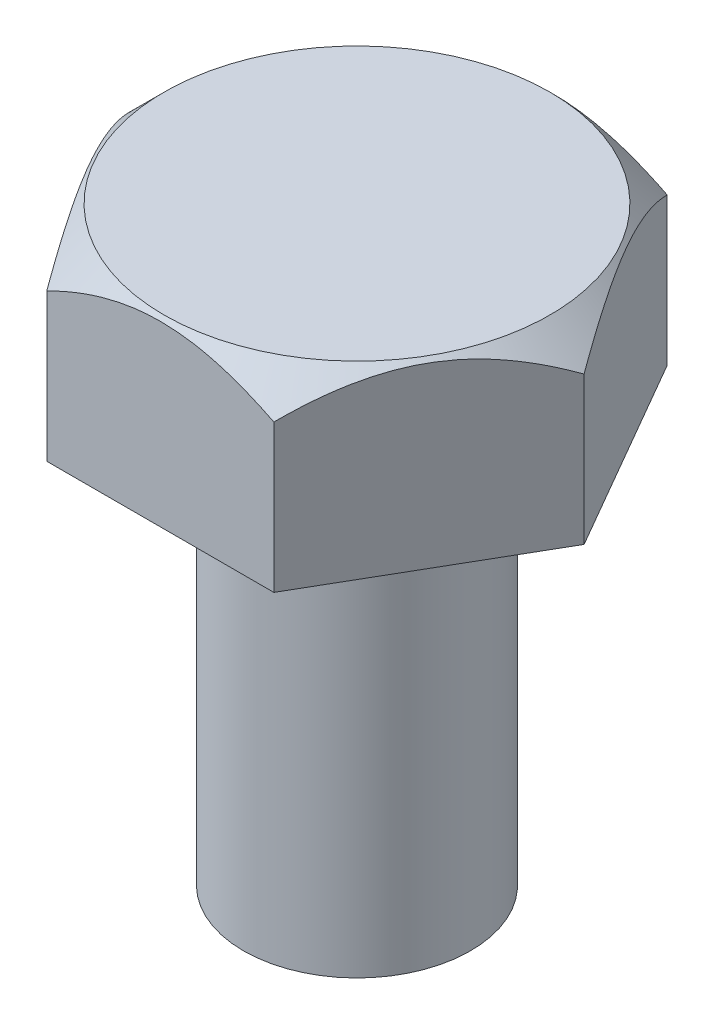
ISO-10303-21;
HEADER;
FILE_DESCRIPTION(('STEP AP214'),'2;1');
FILE_NAME('part.step','',(''),(''),'','','');
FILE_SCHEMA(('AUTOMOTIVE_DESIGN { 1 0 10303 214 1 1 1 1 }'));
ENDSEC;
DATA;
#1=APPLICATION_CONTEXT('core data for automotive mechanical design processes');
#2=APPLICATION_PROTOCOL_DEFINITION('international standard','automotive_design',2000,#1);
#3=PRODUCT_CONTEXT('',#1,'mechanical');
#4=PRODUCT('Part','Part','',(#3));
#5=PRODUCT_RELATED_PRODUCT_CATEGORY('part','',(#4));
#6=PRODUCT_DEFINITION_FORMATION('','',#4);
#7=PRODUCT_DEFINITION_CONTEXT('part definition',#1,'design');
#8=PRODUCT_DEFINITION('design','',#6,#7);
#9=PRODUCT_DEFINITION_SHAPE('','',#8);
#10=(LENGTH_UNIT() NAMED_UNIT(*) SI_UNIT(.MILLI.,.METRE.));
#11=(NAMED_UNIT(*) PLANE_ANGLE_UNIT() SI_UNIT($,.RADIAN.));
#12=(NAMED_UNIT(*) SI_UNIT($,.STERADIAN.) SOLID_ANGLE_UNIT());
#13=UNCERTAINTY_MEASURE_WITH_UNIT(LENGTH_MEASURE(1.E-05),#10,'distance_accuracy_value','');
#14=(GEOMETRIC_REPRESENTATION_CONTEXT(3) GLOBAL_UNCERTAINTY_ASSIGNED_CONTEXT((#13)) GLOBAL_UNIT_ASSIGNED_CONTEXT((#10,
#11,#12)) REPRESENTATION_CONTEXT('',''));
#15=CARTESIAN_POINT('',(0.,0.,0.));
#16=DIRECTION('',(0.,0.,1.));
#17=DIRECTION('',(1.,0.,0.));
#18=AXIS2_PLACEMENT_3D('',#15,#16,#17);
#19=CARTESIAN_POINT('',(2.5,13.,4.33012701892219));
#20=DIRECTION('',(-0.866025403784439,0.,-0.5));
#21=DIRECTION('',(-0.5,0.,0.866025403784439));
#22=AXIS2_PLACEMENT_3D('',#19,#20,#21);
#23=PLANE('',#22);
#24=CARTESIAN_POINT('',(2.49988452994616,12.2498845259463,4.33032701892219));
#25=CARTESIAN_POINT('',(2.54287138041576,12.2928679014172,4.25587160985149));
#26=CARTESIAN_POINT('',(2.58618865330985,12.3345322160249,4.18084389235359));
#27=CARTESIAN_POINT('',(2.67354887274435,12.4148214570814,4.02953155373268));
#28=CARTESIAN_POINT('',(2.71759219997896,12.4534447234691,3.95324627322795));
#29=CARTESIAN_POINT('',(2.85131771209198,12.5644804420678,3.72162689198003));
#30=CARTESIAN_POINT('',(2.94213197757914,12.6315850955109,3.56433197010422));
#31=CARTESIAN_POINT('',(3.12526622915858,12.7464973477853,3.24713414176252));
#32=CARTESIAN_POINT('',(3.2175394030306,12.7945944631137,3.08731231644056));
#33=CARTESIAN_POINT('',(3.35746623690526,12.8502311247179,2.84495193082739));
#34=CARTESIAN_POINT('',(3.40431453249364,12.866017735568,2.76380830262031));
#35=CARTESIAN_POINT('',(3.4984078137364,12.8917307019677,2.60083395885698));
#36=CARTESIAN_POINT('',(3.54565273902893,12.9016579334098,2.51900334785053));
#37=CARTESIAN_POINT('',(3.66078037944807,12.9183021731439,2.31959642528906));
#38=CARTESIAN_POINT('',(3.72878713668329,12.9217946588034,2.20180526649965));
#39=CARTESIAN_POINT('',(3.86467809794897,12.9159341038672,1.96643521729812));
#40=CARTESIAN_POINT('',(3.93256225066695,12.9065765602643,1.84885641576182));
#41=CARTESIAN_POINT('',(4.06769057590286,12.8755675384182,1.61480729091153));
#42=CARTESIAN_POINT('',(4.13493394699394,12.8539023105296,1.49833835570957));
#43=CARTESIAN_POINT('',(4.26826494691757,12.7994557859257,1.26740228961788));
#44=CARTESIAN_POINT('',(4.33435266395686,12.766675341522,1.15293500594959));
#45=CARTESIAN_POINT('',(4.45167355371377,12.6992338613143,0.949729264101427));
#46=CARTESIAN_POINT('',(4.5031664451357,12.6663460937711,0.860540959930025));
#47=CARTESIAN_POINT('',(4.60522781060438,12.5952704801556,0.683765489448419));
#48=CARTESIAN_POINT('',(4.65579625649569,12.5570824729595,0.596178371904874));
#49=CARTESIAN_POINT('',(4.75584946376349,12.476262498628,0.422881133456821));
#50=CARTESIAN_POINT('',(4.80533707077893,12.4336445061233,0.337166083761069));
#51=CARTESIAN_POINT('',(4.90339584958638,12.3445241637333,0.167323296738406));
#52=CARTESIAN_POINT('',(4.95196756146993,12.298024196775,0.0831946239455063));
#53=CARTESIAN_POINT('',(5.00011547005384,12.2498845259463,-0.00020000000000103));
#54=B_SPLINE_CURVE_WITH_KNOTS('',3,(#24,#25,#26,#27,#28,#29,#30,#31,#32,#33,#34,#35,#36,#37,#38,
#39,#40,#41,#42,#43,#44,#45,#46,#47,#48,#49,#50,#51,#52,#53),.UNSPECIFIED.,.F.,.F.,(4,2,2,2,2,2,
2,2,2,2,2,2,2,2,4),(0.,0.288343025050062,0.57684237626667,1.15695604992333,1.72785747296513,
2.01274823950903,2.29759640821264,2.70513724110405,3.1128209240714,3.52096095288679,
3.92906969271705,4.2532461784357,4.57743252106523,4.90062556888121,5.22362166510138),.UNSPECIFIED.);
#55=CARTESIAN_POINT('',(2.5,12.25,4.33012701892219));
#56=VERTEX_POINT('',#55);
#57=CARTESIAN_POINT('',(5.,12.25,0.));
#58=VERTEX_POINT('',#57);
#59=EDGE_CURVE('E92',#56,#58,#54,.T.);
#60=ORIENTED_EDGE('',*,*,#59,.F.);
#61=DIRECTION('',(0.,-1.,0.));
#62=VECTOR('',#61,1.);
#63=CARTESIAN_POINT('',(2.5,13.,4.33012701892219));
#64=LINE('',#63,#62);
#65=CARTESIAN_POINT('',(2.5,9.,4.33012701892219));
#66=VERTEX_POINT('',#65);
#67=EDGE_CURVE('E61',#56,#66,#64,.T.);
#68=ORIENTED_EDGE('',*,*,#67,.T.);
#69=DIRECTION('',(0.5,0.,-0.866025403784439));
#70=VECTOR('',#69,1.);
#71=CARTESIAN_POINT('',(2.5,9.,4.33012701892219));
#72=LINE('',#71,#70);
#73=CARTESIAN_POINT('',(5.,9.,0.));
#74=VERTEX_POINT('',#73);
#75=EDGE_CURVE('E100',#66,#74,#72,.T.);
#76=ORIENTED_EDGE('',*,*,#75,.T.);
#77=DIRECTION('',(0.,-1.,0.));
#78=VECTOR('',#77,1.);
#79=CARTESIAN_POINT('',(5.,13.,0.));
#80=LINE('',#79,#78);
#81=EDGE_CURVE('E99',#58,#74,#80,.T.);
#82=ORIENTED_EDGE('',*,*,#81,.F.);
#83=EDGE_LOOP('',(#60,#68,#76,#82));
#84=FACE_BOUND('',#83,.T.);
#85=ADVANCED_FACE('F38',(#84),#23,.F.);
#86=CARTESIAN_POINT('',(5.,13.,0.));
#87=DIRECTION('',(-0.866025403784439,0.,0.5));
#88=DIRECTION('',(0.5,0.,0.866025403784439));
#89=AXIS2_PLACEMENT_3D('',#86,#87,#88);
#90=PLANE('',#89);
#91=CARTESIAN_POINT('',(5.00011547005384,12.2498845259463,0.000199999999998585));
#92=CARTESIAN_POINT('',(4.95712861958424,12.2928679014172,-0.0742554090707067));
#93=CARTESIAN_POINT('',(4.91381134669015,12.3345322160249,-0.149283126568604));
#94=CARTESIAN_POINT('',(4.82645112725565,12.4148214570814,-0.300595465189513));
#95=CARTESIAN_POINT('',(4.78240780002104,12.4534447234691,-0.376880745694241));
#96=CARTESIAN_POINT('',(4.64868228790802,12.5644804420678,-0.608500126942165));
#97=CARTESIAN_POINT('',(4.55786802242086,12.6315850955109,-0.765795048817976));
#98=CARTESIAN_POINT('',(4.37473377084142,12.7464973477853,-1.08299287715967));
#99=CARTESIAN_POINT('',(4.28246059696941,12.7945944631137,-1.24281470248163));
#100=CARTESIAN_POINT('',(4.14253376309474,12.8502311247179,-1.4851750880948));
#101=CARTESIAN_POINT('',(4.09568546750636,12.866017735568,-1.56631871630188));
#102=CARTESIAN_POINT('',(4.0015921862636,12.8917307019677,-1.72929306006521));
#103=CARTESIAN_POINT('',(3.95434726097107,12.9016579334098,-1.81112367107166));
#104=CARTESIAN_POINT('',(3.83921962055194,12.9183021731439,-2.01053059363313));
#105=CARTESIAN_POINT('',(3.77121286331671,12.9217946588034,-2.12832175242254));
#106=CARTESIAN_POINT('',(3.63532190205103,12.9159341038672,-2.36369180162407));
#107=CARTESIAN_POINT('',(3.56743774933305,12.9065765602643,-2.48127060316037));
#108=CARTESIAN_POINT('',(3.43230942409714,12.8755675384182,-2.71531972801066));
#109=CARTESIAN_POINT('',(3.36506605300606,12.8539023105296,-2.83178866321262));
#110=CARTESIAN_POINT('',(3.23173505308243,12.7994557859257,-3.06272472930431));
#111=CARTESIAN_POINT('',(3.16564733604314,12.766675341522,-3.1771920129726));
#112=CARTESIAN_POINT('',(3.04832644628623,12.6992338613143,-3.38039775482076));
#113=CARTESIAN_POINT('',(2.9968335548643,12.6663460937711,-3.46958605899217));
#114=CARTESIAN_POINT('',(2.89477218939562,12.5952704801556,-3.64636152947377));
#115=CARTESIAN_POINT('',(2.84420374350431,12.5570824729595,-3.73394864701732));
#116=CARTESIAN_POINT('',(2.74415053623651,12.476262498628,-3.90724588546537));
#117=CARTESIAN_POINT('',(2.69466292922106,12.4336445061233,-3.99296093516112));
#118=CARTESIAN_POINT('',(2.59660415041361,12.3445241637333,-4.16280372218379));
#119=CARTESIAN_POINT('',(2.54803243853007,12.298024196775,-4.24693239497669));
#120=CARTESIAN_POINT('',(2.49988452994616,12.2498845259463,-4.33032701892219));
#121=B_SPLINE_CURVE_WITH_KNOTS('',3,(#91,#92,#93,#94,#95,#96,#97,#98,#99,#100,#101,#102,#103,
#104,#105,#106,#107,#108,#109,#110,#111,#112,#113,#114,#115,#116,#117,#118,#119,#120),
.UNSPECIFIED.,.F.,.F.,(4,2,2,2,2,2,2,2,2,2,2,2,2,2,4),(0.,0.288343025050062,0.576842376266668,
1.15695604992332,1.72785747296512,2.01274823950903,2.29759640821263,2.70513724110404,
3.1128209240714,3.52096095288678,3.92906969271705,4.2532461784357,4.57743252106523,
4.90062556888121,5.22362166510138),.UNSPECIFIED.);
#122=CARTESIAN_POINT('',(2.5,12.25,-4.3301270189222));
#123=VERTEX_POINT('',#122);
#124=EDGE_CURVE('E101',#58,#123,#121,.T.);
#125=ORIENTED_EDGE('',*,*,#124,.F.);
#126=ORIENTED_EDGE('',*,*,#81,.T.);
#127=DIRECTION('',(-0.5,0.,-0.866025403784439));
#128=VECTOR('',#127,1.);
#129=CARTESIAN_POINT('',(5.,9.,0.));
#130=LINE('',#129,#128);
#131=CARTESIAN_POINT('',(2.5,9.,-4.3301270189222));
#132=VERTEX_POINT('',#131);
#133=EDGE_CURVE('E310',#74,#132,#130,.T.);
#134=ORIENTED_EDGE('',*,*,#133,.T.);
#135=DIRECTION('',(0.,-1.,0.));
#136=VECTOR('',#135,1.);
#137=CARTESIAN_POINT('',(2.5,13.,-4.3301270189222));
#138=LINE('',#137,#136);
#139=EDGE_CURVE('E118',#123,#132,#138,.T.);
#140=ORIENTED_EDGE('',*,*,#139,.F.);
#141=EDGE_LOOP('',(#125,#126,#134,#140));
#142=FACE_BOUND('',#141,.T.);
#143=ADVANCED_FACE('F139',(#142),#90,.F.);
#144=CARTESIAN_POINT('',(2.5,13.,-4.3301270189222));
#145=DIRECTION('',(0.,0.,1.));
#146=DIRECTION('',(1.,0.,0.));
#147=AXIS2_PLACEMENT_3D('',#144,#145,#146);
#148=PLANE('',#147);
#149=CARTESIAN_POINT('',(8.90332423743285,7.34953624940433,-4.3301270189222));
#150=CARTESIAN_POINT('',(8.77359372403535,7.46619813838228,-4.3301270189222));
#151=CARTESIAN_POINT('',(8.64362341139327,7.58259353075673,-4.3301270189222));
#152=CARTESIAN_POINT('',(8.38313697699274,7.81477394586672,-4.3301270189222));
#153=CARTESIAN_POINT('',(8.2526208508695,7.93055896370439,-4.3301270189222));
#154=CARTESIAN_POINT('',(7.86007643569823,8.27695117481604,-4.3301270189222));
#155=CARTESIAN_POINT('',(7.59713247560989,8.50652308566762,-4.3301270189222));
#156=CARTESIAN_POINT('',(7.0652685539269,8.96450158796207,-4.3301270189222));
#157=CARTESIAN_POINT('',(6.79631473050352,9.19286900167135,-4.3301270189222));
#158=CARTESIAN_POINT('',(6.38976041108224,9.53161549684158,-4.3301270189222));
#159=CARTESIAN_POINT('',(6.25373574873947,9.64388562717895,-4.3301270189222));
#160=CARTESIAN_POINT('',(5.98045222397718,9.86693976740922,-4.3301270189222));
#161=CARTESIAN_POINT('',(5.84319324976469,9.97772364037908,-4.3301270189222));
#162=CARTESIAN_POINT('',(5.45346089613165,10.288177318387,-4.3301270189222));
#163=CARTESIAN_POINT('',(5.19934061251997,10.4857900155766,-4.3301270189222));
#164=CARTESIAN_POINT('',(4.68488393376395,10.8727528787202,-4.3301270189222));
#165=CARTESIAN_POINT('',(4.42454861466638,11.0621044591484,-4.3301270189222));
#166=CARTESIAN_POINT('',(4.02801362413032,11.3368009899614,-4.3301270189222));
#167=CARTESIAN_POINT('',(3.89498233013086,11.4267158491027,-4.3301270189222));
#168=CARTESIAN_POINT('',(3.62646525444372,11.6027927154233,-4.3301270189222));
#169=CARTESIAN_POINT('',(3.49097969774515,11.688955064165,-4.3301270189222));
#170=CARTESIAN_POINT('',(3.21725503933809,11.8565749222978,-4.3301270189222));
#171=CARTESIAN_POINT('',(3.07901807615046,11.9380359074437,-4.3301270189222));
#172=CARTESIAN_POINT('',(2.799285191279,12.0951379593684,-4.3301270189222));
#173=CARTESIAN_POINT('',(2.65778986445492,12.1707800776879,-4.3301270189222));
#174=CARTESIAN_POINT('',(2.3803579204845,12.3100947964188,-4.3301270189222));
#175=CARTESIAN_POINT('',(2.2446526608159,12.3742249554102,-4.3301270189222));
#176=CARTESIAN_POINT('',(1.96971474521903,12.4945294017598,-4.3301270189222));
#177=CARTESIAN_POINT('',(1.83048187488554,12.5507032041632,-4.3301270189222));
#178=CARTESIAN_POINT('',(1.54877705851321,12.6530937662029,-4.3301270189222));
#179=CARTESIAN_POINT('',(1.40631466540164,12.699336497152,-4.3301270189222));
#180=CARTESIAN_POINT('',(1.1180913649319,12.7799858248732,-4.3301270189222));
#181=CARTESIAN_POINT('',(0.972332093955243,12.814398161899,-4.3301270189222));
#182=CARTESIAN_POINT('',(0.700274540847439,12.8653329060784,-4.3301270189222));
#183=CARTESIAN_POINT('',(0.574335711842037,12.8837642187726,-4.3301270189222));
#184=CARTESIAN_POINT('',(0.32134167819188,12.9097877119627,-4.3301270189222));
#185=CARTESIAN_POINT('',(0.19428664261471,12.9173815064383,-4.3301270189222));
#186=CARTESIAN_POINT('',(-0.0598970646350651,12.9213217927638,-4.3301270189222));
#187=CARTESIAN_POINT('',(-0.18702559144265,12.9176774644556,-4.3301270189222));
#188=CARTESIAN_POINT('',(-0.440487928018705,12.899363753421,-4.3301270189222));
#189=CARTESIAN_POINT('',(-0.566821611457223,12.8846926606492,-4.3301270189222));
#190=CARTESIAN_POINT('',(-0.853499112508733,12.8394266575765,-4.3301270189222));
#191=CARTESIAN_POINT('',(-1.01331558017307,12.8054933670171,-4.3301270189222));
#192=CARTESIAN_POINT('',(-1.32917470064156,12.7230373762208,-4.3301270189222));
#193=CARTESIAN_POINT('',(-1.4852147582021,12.6745049343799,-4.3301270189222));
#194=CARTESIAN_POINT('',(-1.71645429081949,12.592642484831,-4.3301270189222));
#195=CARTESIAN_POINT('',(-1.79327046052375,12.5637527245411,-4.3301270189222));
#196=CARTESIAN_POINT('',(-1.94580192515183,12.5032910949563,-4.3301270189222));
#197=CARTESIAN_POINT('',(-2.02151771557542,12.4717204796219,-4.3301270189222));
#198=CARTESIAN_POINT('',(-2.17189298192116,12.4061855051134,-4.3301270189222));
#199=CARTESIAN_POINT('',(-2.24655255565585,12.3722213693604,-4.3301270189222));
#200=CARTESIAN_POINT('',(-2.39487162500877,12.3021581197154,-4.3301270189222));
#201=CARTESIAN_POINT('',(-2.46853099103001,12.2660587323436,-4.3301270189222));
#202=CARTESIAN_POINT('',(-2.66441202982777,12.1669025360952,-4.3301270189222));
#203=CARTESIAN_POINT('',(-2.78576837690447,12.1021331461381,-4.3301270189222));
#204=CARTESIAN_POINT('',(-3.02605740995251,11.9682302837863,-4.3301270189222));
#205=CARTESIAN_POINT('',(-3.14498965595039,11.8990960283378,-4.3301270189222));
#206=CARTESIAN_POINT('',(-3.49868630626235,11.686262322545,-4.3301270189222));
#207=CARTESIAN_POINT('',(-3.73022285915577,11.5371986356887,-4.3301270189222));
#208=CARTESIAN_POINT('',(-4.18717151517889,11.228870478968,-4.3301270189222));
#209=CARTESIAN_POINT('',(-4.41256614778244,11.0695805181884,-4.3301270189222));
#210=CARTESIAN_POINT('',(-4.85810627697254,10.7439949584243,-4.3301270189222));
#211=CARTESIAN_POINT('',(-5.0782533827837,10.5777015515748,-4.3301270189222));
#212=CARTESIAN_POINT('',(-5.5152988912486,10.2393400787856,-4.3301270189222));
#213=CARTESIAN_POINT('',(-5.73218292616218,10.0672535508736,-4.3301270189222));
#214=CARTESIAN_POINT('',(-6.16278072868354,9.71914184825556,-4.3301270189222));
#215=CARTESIAN_POINT('',(-6.37649428887319,9.54311641773274,-4.3301270189222));
#216=CARTESIAN_POINT('',(-6.80110576416486,9.18827098944291,-4.3301270189222));
#217=CARTESIAN_POINT('',(-7.0120070105743,9.00945496845219,-4.3301270189222));
#218=CARTESIAN_POINT('',(-7.43176242196089,8.64945019126485,-4.3301270189222));
#219=CARTESIAN_POINT('',(-7.64061663695679,8.46826149329803,-4.3301270189222));
#220=CARTESIAN_POINT('',(-8.02584653913027,8.13096062357634,-4.3301270189222));
#221=CARTESIAN_POINT('',(-8.20245091257011,7.97510918501013,-4.3301270189222));
#222=CARTESIAN_POINT('',(-8.55395138171449,7.66283850766755,-4.3301270189222));
#223=CARTESIAN_POINT('',(-8.72885142676749,7.50642371610311,-4.3301270189222));
#224=CARTESIAN_POINT('',(-8.90332423743285,7.34953624940433,-4.3301270189222));
#225=B_SPLINE_CURVE_WITH_KNOTS('',3,(#149,#150,#151,#152,#153,#154,#155,#156,#157,#158,#159,
#160,#161,#162,#163,#164,#165,#166,#167,#168,#169,#170,#171,#172,#173,#174,#175,#176,#177,#178,
#179,#180,#181,#182,#183,#184,#185,#186,#187,#188,#189,#190,#191,#192,#193,#194,#195,#196,#197,
#198,#199,#200,#201,#202,#203,#204,#205,#206,#207,#208,#209,#210,#211,#212,#213,#214,#215,#216,
#217,#218,#219,#220,#221,#222,#223,#224),.UNSPECIFIED.,.F.,.F.,(4,2,2,2,2,2,2,2,2,2,2,2,2,2,2,2,
2,2,2,2,2,2,2,2,2,2,2,2,2,2,2,2,2,2,2,2,2,4),(0.,0.523411496049794,1.04682718577394,
2.09398313596665,3.15241670413788,3.68152550137059,4.21068271314228,5.17631419069354,
6.14177967802374,6.62343462040013,7.10504562936265,7.58629589406515,8.06745898564356,
8.51754017126107,8.9676487783723,9.41656554687357,9.86526418694705,10.246676195505,
10.628031396268,11.0090751702091,11.3901780491258,11.8794803992404,12.3691099740729,
12.6152765072058,12.8613285244576,13.1073576045335,13.3534182641467,13.7659743535893,
14.1786046667622,15.0042968632217,15.832133805225,16.6597135259092,17.4902415438087,
18.3208236588329,19.1503141874776,19.979784396929,20.6863971747289,21.3903090973452),.UNSPECIFIED.);
#226=CARTESIAN_POINT('',(-2.5,12.25,-4.3301270189222));
#227=VERTEX_POINT('',#226);
#228=EDGE_CURVE('E190',#123,#227,#225,.T.);
#229=ORIENTED_EDGE('',*,*,#228,.F.);
#230=ORIENTED_EDGE('',*,*,#139,.T.);
#231=DIRECTION('',(-1.,0.,0.));
#232=VECTOR('',#231,1.);
#233=CARTESIAN_POINT('',(2.5,9.,-4.3301270189222));
#234=LINE('',#233,#232);
#235=CARTESIAN_POINT('',(-2.5,9.,-4.3301270189222));
#236=VERTEX_POINT('',#235);
#237=EDGE_CURVE('E307',#132,#236,#234,.T.);
#238=ORIENTED_EDGE('',*,*,#237,.T.);
#239=DIRECTION('',(0.,-1.,0.));
#240=VECTOR('',#239,1.);
#241=CARTESIAN_POINT('',(-2.5,13.,-4.3301270189222));
#242=LINE('',#241,#240);
#243=EDGE_CURVE('E116',#227,#236,#242,.T.);
#244=ORIENTED_EDGE('',*,*,#243,.F.);
#245=EDGE_LOOP('',(#229,#230,#238,#244));
#246=FACE_BOUND('',#245,.T.);
#247=ADVANCED_FACE('F143',(#246),#148,.F.);
#248=CARTESIAN_POINT('',(-2.5,13.,-4.3301270189222));
#249=DIRECTION('',(0.866025403784439,0.,0.5));
#250=DIRECTION('',(0.5,0.,-0.866025403784439));
#251=AXIS2_PLACEMENT_3D('',#248,#249,#250);
#252=PLANE('',#251);
#253=CARTESIAN_POINT('',(-2.49988452994616,12.2498845259463,-4.33032701892219));
#254=CARTESIAN_POINT('',(-2.54287138041576,12.2928679014172,-4.25587160985149));
#255=CARTESIAN_POINT('',(-2.58618865330986,12.3345322160249,-4.18084389235359));
#256=CARTESIAN_POINT('',(-2.67354887274435,12.4148214570814,-4.02953155373268));
#257=CARTESIAN_POINT('',(-2.71759219997896,12.4534447234691,-3.95324627322795));
#258=CARTESIAN_POINT('',(-2.85131771209198,12.5644804420678,-3.72162689198003));
#259=CARTESIAN_POINT('',(-2.94213197757914,12.6315850955109,-3.56433197010422));
#260=CARTESIAN_POINT('',(-3.12526622915858,12.7464973477853,-3.24713414176252));
#261=CARTESIAN_POINT('',(-3.2175394030306,12.7945944631137,-3.08731231644056));
#262=CARTESIAN_POINT('',(-3.35746623690526,12.8502311247179,-2.8449519308274));
#263=CARTESIAN_POINT('',(-3.40431453249364,12.866017735568,-2.76380830262031));
#264=CARTESIAN_POINT('',(-3.4984078137364,12.8917307019677,-2.60083395885698));
#265=CARTESIAN_POINT('',(-3.54565273902893,12.9016579334098,-2.51900334785053));
#266=CARTESIAN_POINT('',(-3.66078037944807,12.9183021731439,-2.31959642528906));
#267=CARTESIAN_POINT('',(-3.72878713668329,12.9217946588034,-2.20180526649965));
#268=CARTESIAN_POINT('',(-3.86467809794897,12.9159341038672,-1.96643521729812));
#269=CARTESIAN_POINT('',(-3.93256225066695,12.9065765602643,-1.84885641576182));
#270=CARTESIAN_POINT('',(-4.06769057590286,12.8755675384182,-1.61480729091153));
#271=CARTESIAN_POINT('',(-4.13493394699394,12.8539023105296,-1.49833835570957));
#272=CARTESIAN_POINT('',(-4.26826494691757,12.7994557859257,-1.26740228961788));
#273=CARTESIAN_POINT('',(-4.33435266395686,12.766675341522,-1.15293500594959));
#274=CARTESIAN_POINT('',(-4.45167355371378,12.6992338613143,-0.949729264101426));
#275=CARTESIAN_POINT('',(-4.5031664451357,12.6663460937711,-0.860540959930024));
#276=CARTESIAN_POINT('',(-4.60522781060438,12.5952704801556,-0.683765489448418));
#277=CARTESIAN_POINT('',(-4.65579625649569,12.5570824729595,-0.596178371904873));
#278=CARTESIAN_POINT('',(-4.75584946376349,12.476262498628,-0.42288113345682));
#279=CARTESIAN_POINT('',(-4.80533707077894,12.4336445061233,-0.337166083761069));
#280=CARTESIAN_POINT('',(-4.90339584958639,12.3445241637333,-0.167323296738406));
#281=CARTESIAN_POINT('',(-4.95196756146993,12.298024196775,-0.0831946239455071));
#282=CARTESIAN_POINT('',(-5.00011547005384,12.2498845259463,0.000200000000000461));
#283=B_SPLINE_CURVE_WITH_KNOTS('',3,(#253,#254,#255,#256,#257,#258,#259,#260,#261,#262,#263,
#264,#265,#266,#267,#268,#269,#270,#271,#272,#273,#274,#275,#276,#277,#278,#279,#280,#281,#282),
.UNSPECIFIED.,.F.,.F.,(4,2,2,2,2,2,2,2,2,2,2,2,2,2,4),(0.,0.288343025050063,0.576842376266671,
1.15695604992332,1.72785747296513,2.01274823950903,2.29759640821264,2.70513724110405,
3.1128209240714,3.52096095288679,3.92906969271705,4.2532461784357,4.57743252106523,
4.90062556888121,5.22362166510138),.UNSPECIFIED.);
#284=CARTESIAN_POINT('',(-5.,12.25,0.));
#285=VERTEX_POINT('',#284);
#286=EDGE_CURVE('E184',#227,#285,#283,.T.);
#287=ORIENTED_EDGE('',*,*,#286,.F.);
#288=ORIENTED_EDGE('',*,*,#243,.T.);
#289=DIRECTION('',(-0.499999999999999,0.,0.866025403784439));
#290=VECTOR('',#289,1.);
#291=CARTESIAN_POINT('',(-2.5,9.,-4.3301270189222));
#292=LINE('',#291,#290);
#293=CARTESIAN_POINT('',(-5.,9.,0.));
#294=VERTEX_POINT('',#293);
#295=EDGE_CURVE('E302',#236,#294,#292,.T.);
#296=ORIENTED_EDGE('',*,*,#295,.T.);
#297=DIRECTION('',(0.,-1.,0.));
#298=VECTOR('',#297,1.);
#299=CARTESIAN_POINT('',(-5.,13.,0.));
#300=LINE('',#299,#298);
#301=EDGE_CURVE('E109',#285,#294,#300,.T.);
#302=ORIENTED_EDGE('',*,*,#301,.F.);
#303=EDGE_LOOP('',(#287,#288,#296,#302));
#304=FACE_BOUND('',#303,.T.);
#305=ADVANCED_FACE('F197',(#304),#252,.F.);
#306=CARTESIAN_POINT('',(-5.,13.,0.));
#307=DIRECTION('',(0.866025403784439,0.,-0.5));
#308=DIRECTION('',(-0.5,0.,-0.866025403784439));
#309=AXIS2_PLACEMENT_3D('',#306,#307,#308);
#310=PLANE('',#309);
#311=CARTESIAN_POINT('',(-5.00011547005384,12.2498845259463,-0.000199999999999336));
#312=CARTESIAN_POINT('',(-4.95712861958424,12.2928679014172,0.0742554090707064));
#313=CARTESIAN_POINT('',(-4.91381134669015,12.3345322160249,0.149283126568604));
#314=CARTESIAN_POINT('',(-4.82645112725566,12.4148214570814,0.300595465189513));
#315=CARTESIAN_POINT('',(-4.78240780002105,12.4534447234691,0.37688074569424));
#316=CARTESIAN_POINT('',(-4.64868228790802,12.5644804420678,0.608500126942164));
#317=CARTESIAN_POINT('',(-4.55786802242086,12.6315850955109,0.765795048817976));
#318=CARTESIAN_POINT('',(-4.37473377084142,12.7464973477853,1.08299287715967));
#319=CARTESIAN_POINT('',(-4.28246059696941,12.7945944631137,1.24281470248163));
#320=CARTESIAN_POINT('',(-4.14253376309474,12.8502311247179,1.4851750880948));
#321=CARTESIAN_POINT('',(-4.09568546750636,12.866017735568,1.56631871630188));
#322=CARTESIAN_POINT('',(-4.0015921862636,12.8917307019677,1.72929306006521));
#323=CARTESIAN_POINT('',(-3.95434726097107,12.9016579334098,1.81112367107166));
#324=CARTESIAN_POINT('',(-3.83921962055194,12.9183021731439,2.01053059363313));
#325=CARTESIAN_POINT('',(-3.77121286331671,12.9217946588034,2.12832175242254));
#326=CARTESIAN_POINT('',(-3.63532190205103,12.9159341038672,2.36369180162407));
#327=CARTESIAN_POINT('',(-3.56743774933305,12.9065765602643,2.48127060316037));
#328=CARTESIAN_POINT('',(-3.43230942409714,12.8755675384182,2.71531972801066));
#329=CARTESIAN_POINT('',(-3.36506605300606,12.8539023105296,2.83178866321263));
#330=CARTESIAN_POINT('',(-3.23173505308243,12.7994557859257,3.06272472930431));
#331=CARTESIAN_POINT('',(-3.16564733604314,12.766675341522,3.1771920129726));
#332=CARTESIAN_POINT('',(-3.04832644628623,12.6992338613143,3.38039775482076));
#333=CARTESIAN_POINT('',(-2.9968335548643,12.6663460937711,3.46958605899217));
#334=CARTESIAN_POINT('',(-2.89477218939562,12.5952704801556,3.64636152947377));
#335=CARTESIAN_POINT('',(-2.84420374350431,12.5570824729595,3.73394864701732));
#336=CARTESIAN_POINT('',(-2.74415053623651,12.476262498628,3.90724588546537));
#337=CARTESIAN_POINT('',(-2.69466292922107,12.4336445061233,3.99296093516112));
#338=CARTESIAN_POINT('',(-2.59660415041362,12.3445241637333,4.16280372218379));
#339=CARTESIAN_POINT('',(-2.54803243853007,12.298024196775,4.24693239497669));
#340=CARTESIAN_POINT('',(-2.49988452994616,12.2498845259463,4.33032701892219));
#341=B_SPLINE_CURVE_WITH_KNOTS('',3,(#311,#312,#313,#314,#315,#316,#317,#318,#319,#320,#321,
#322,#323,#324,#325,#326,#327,#328,#329,#330,#331,#332,#333,#334,#335,#336,#337,#338,#339,#340),
.UNSPECIFIED.,.F.,.F.,(4,2,2,2,2,2,2,2,2,2,2,2,2,2,4),(0.,0.288343025050062,0.576842376266668,
1.15695604992332,1.72785747296512,2.01274823950903,2.29759640821263,2.70513724110404,
3.1128209240714,3.52096095288678,3.92906969271705,4.2532461784357,4.57743252106523,
4.90062556888121,5.22362166510138),.UNSPECIFIED.);
#342=CARTESIAN_POINT('',(-2.5,12.25,4.33012701892219));
#343=VERTEX_POINT('',#342);
#344=EDGE_CURVE('E53',#285,#343,#341,.T.);
#345=ORIENTED_EDGE('',*,*,#344,.F.);
#346=ORIENTED_EDGE('',*,*,#301,.T.);
#347=DIRECTION('',(0.5,0.,0.866025403784439));
#348=VECTOR('',#347,1.);
#349=CARTESIAN_POINT('',(-5.,9.,0.));
#350=LINE('',#349,#348);
#351=CARTESIAN_POINT('',(-2.5,9.,4.33012701892219));
#352=VERTEX_POINT('',#351);
#353=EDGE_CURVE('E111',#294,#352,#350,.T.);
#354=ORIENTED_EDGE('',*,*,#353,.T.);
#355=DIRECTION('',(0.,-1.,0.));
#356=VECTOR('',#355,1.);
#357=CARTESIAN_POINT('',(-2.5,13.,4.33012701892219));
#358=LINE('',#357,#356);
#359=EDGE_CURVE('E107',#343,#352,#358,.T.);
#360=ORIENTED_EDGE('',*,*,#359,.F.);
#361=EDGE_LOOP('',(#345,#346,#354,#360));
#362=FACE_BOUND('',#361,.T.);
#363=ADVANCED_FACE('F201',(#362),#310,.F.);
#364=CARTESIAN_POINT('',(-2.5,13.,4.33012701892219));
#365=DIRECTION('',(0.,0.,-1.));
#366=DIRECTION('',(-1.,0.,0.));
#367=AXIS2_PLACEMENT_3D('',#364,#365,#366);
#368=PLANE('',#367);
#369=CARTESIAN_POINT('',(-8.90332423743285,7.34953624940433,4.33012701892219));
#370=CARTESIAN_POINT('',(-8.77359372403536,7.46619813838228,4.33012701892219));
#371=CARTESIAN_POINT('',(-8.64362341139328,7.58259353075673,4.33012701892219));
#372=CARTESIAN_POINT('',(-8.38313697699274,7.81477394586672,4.33012701892219));
#373=CARTESIAN_POINT('',(-8.25262085086951,7.93055896370439,4.33012701892219));
#374=CARTESIAN_POINT('',(-7.86007643569823,8.27695117481604,4.33012701892219));
#375=CARTESIAN_POINT('',(-7.59713247560989,8.50652308566762,4.33012701892219));
#376=CARTESIAN_POINT('',(-7.0652685539269,8.96450158796207,4.33012701892219));
#377=CARTESIAN_POINT('',(-6.79631473050353,9.19286900167135,4.33012701892219));
#378=CARTESIAN_POINT('',(-6.38976041108224,9.53161549684158,4.33012701892219));
#379=CARTESIAN_POINT('',(-6.25373574873948,9.64388562717895,4.33012701892219));
#380=CARTESIAN_POINT('',(-5.98045222397718,9.86693976740922,4.33012701892219));
#381=CARTESIAN_POINT('',(-5.8431932497647,9.97772364037908,4.33012701892219));
#382=CARTESIAN_POINT('',(-5.45346089613165,10.288177318387,4.33012701892219));
#383=CARTESIAN_POINT('',(-5.19934061251998,10.4857900155766,4.33012701892219));
#384=CARTESIAN_POINT('',(-4.68488393376395,10.8727528787202,4.33012701892219));
#385=CARTESIAN_POINT('',(-4.42454861466638,11.0621044591484,4.33012701892219));
#386=CARTESIAN_POINT('',(-4.02801362413032,11.3368009899614,4.33012701892219));
#387=CARTESIAN_POINT('',(-3.89498233013087,11.4267158491027,4.33012701892219));
#388=CARTESIAN_POINT('',(-3.62646525444372,11.6027927154233,4.33012701892219));
#389=CARTESIAN_POINT('',(-3.49097969774516,11.688955064165,4.33012701892219));
#390=CARTESIAN_POINT('',(-3.21725503933809,11.8565749222978,4.33012701892219));
#391=CARTESIAN_POINT('',(-3.07901807615047,11.9380359074437,4.33012701892219));
#392=CARTESIAN_POINT('',(-2.799285191279,12.0951379593684,4.33012701892219));
#393=CARTESIAN_POINT('',(-2.65778986445493,12.1707800776879,4.33012701892219));
#394=CARTESIAN_POINT('',(-2.3803579204845,12.3100947964188,4.33012701892219));
#395=CARTESIAN_POINT('',(-2.2446526608159,12.3742249554102,4.33012701892219));
#396=CARTESIAN_POINT('',(-1.96971474521903,12.4945294017598,4.33012701892219));
#397=CARTESIAN_POINT('',(-1.83048187488554,12.5507032041632,4.33012701892219));
#398=CARTESIAN_POINT('',(-1.54877705851322,12.6530937662029,4.33012701892219));
#399=CARTESIAN_POINT('',(-1.40631466540165,12.699336497152,4.33012701892219));
#400=CARTESIAN_POINT('',(-1.1180913649319,12.7799858248732,4.33012701892219));
#401=CARTESIAN_POINT('',(-0.972332093955247,12.814398161899,4.33012701892219));
#402=CARTESIAN_POINT('',(-0.700274540847444,12.8653329060784,4.33012701892219));
#403=CARTESIAN_POINT('',(-0.574335711842042,12.8837642187726,4.33012701892219));
#404=CARTESIAN_POINT('',(-0.321341678191886,12.9097877119627,4.33012701892219));
#405=CARTESIAN_POINT('',(-0.194286642614716,12.9173815064383,4.33012701892219));
#406=CARTESIAN_POINT('',(0.0598970646350584,12.9213217927638,4.33012701892219));
#407=CARTESIAN_POINT('',(0.187025591442643,12.9176774644556,4.33012701892219));
#408=CARTESIAN_POINT('',(0.440487928018698,12.899363753421,4.33012701892219));
#409=CARTESIAN_POINT('',(0.566821611457216,12.8846926606492,4.33012701892219));
#410=CARTESIAN_POINT('',(0.853499112508727,12.8394266575766,4.33012701892219));
#411=CARTESIAN_POINT('',(1.01331558017307,12.8054933670171,4.33012701892219));
#412=CARTESIAN_POINT('',(1.32917470064155,12.7230373762208,4.33012701892219));
#413=CARTESIAN_POINT('',(1.4852147582021,12.6745049343799,4.33012701892219));
#414=CARTESIAN_POINT('',(1.71645429081948,12.5926424848311,4.33012701892219));
#415=CARTESIAN_POINT('',(1.79327046052374,12.5637527245411,4.33012701892219));
#416=CARTESIAN_POINT('',(1.94580192515182,12.5032910949563,4.33012701892219));
#417=CARTESIAN_POINT('',(2.02151771557542,12.4717204796219,4.33012701892219));
#418=CARTESIAN_POINT('',(2.17189298192115,12.4061855051134,4.33012701892219));
#419=CARTESIAN_POINT('',(2.24655255565584,12.3722213693604,4.33012701892219));
#420=CARTESIAN_POINT('',(2.39487162500877,12.3021581197154,4.33012701892219));
#421=CARTESIAN_POINT('',(2.46853099103,12.2660587323436,4.33012701892219));
#422=CARTESIAN_POINT('',(2.66441202982776,12.1669025360952,4.33012701892219));
#423=CARTESIAN_POINT('',(2.78576837690446,12.1021331461382,4.33012701892219));
#424=CARTESIAN_POINT('',(3.0260574099525,11.9682302837863,4.33012701892219));
#425=CARTESIAN_POINT('',(3.14498965595038,11.8990960283378,4.33012701892219));
#426=CARTESIAN_POINT('',(3.49868630626234,11.686262322545,4.33012701892219));
#427=CARTESIAN_POINT('',(3.73022285915576,11.5371986356887,4.33012701892219));
#428=CARTESIAN_POINT('',(4.18717151517887,11.228870478968,4.33012701892219));
#429=CARTESIAN_POINT('',(4.41256614778243,11.0695805181884,4.33012701892219));
#430=CARTESIAN_POINT('',(4.85810627697252,10.7439949584243,4.33012701892219));
#431=CARTESIAN_POINT('',(5.07825338278368,10.5777015515748,4.3301270189222));
#432=CARTESIAN_POINT('',(5.51529889124858,10.2393400787857,4.3301270189222));
#433=CARTESIAN_POINT('',(5.73218292616216,10.0672535508736,4.3301270189222));
#434=CARTESIAN_POINT('',(6.16278072868352,9.71914184825558,4.3301270189222));
#435=CARTESIAN_POINT('',(6.37649428887317,9.54311641773276,4.3301270189222));
#436=CARTESIAN_POINT('',(6.80110576416483,9.18827098944293,4.3301270189222));
#437=CARTESIAN_POINT('',(7.01200701057427,9.00945496845221,4.3301270189222));
#438=CARTESIAN_POINT('',(7.43176242196087,8.64945019126487,4.3301270189222));
#439=CARTESIAN_POINT('',(7.64061663695676,8.46826149329805,4.3301270189222));
#440=CARTESIAN_POINT('',(8.02584653913025,8.13096062357636,4.3301270189222));
#441=CARTESIAN_POINT('',(8.20245091257009,7.97510918501015,4.3301270189222));
#442=CARTESIAN_POINT('',(8.55395138171447,7.66283850766756,4.3301270189222));
#443=CARTESIAN_POINT('',(8.72885142676748,7.50642371610312,4.3301270189222));
#444=CARTESIAN_POINT('',(8.90332423743285,7.34953624940433,4.3301270189222));
#445=B_SPLINE_CURVE_WITH_KNOTS('',3,(#369,#370,#371,#372,#373,#374,#375,#376,#377,#378,#379,
#380,#381,#382,#383,#384,#385,#386,#387,#388,#389,#390,#391,#392,#393,#394,#395,#396,#397,#398,
#399,#400,#401,#402,#403,#404,#405,#406,#407,#408,#409,#410,#411,#412,#413,#414,#415,#416,#417,
#418,#419,#420,#421,#422,#423,#424,#425,#426,#427,#428,#429,#430,#431,#432,#433,#434,#435,#436,
#437,#438,#439,#440,#441,#442,#443,#444),.UNSPECIFIED.,.F.,.F.,(4,2,2,2,2,2,2,2,2,2,2,2,2,2,2,2,
2,2,2,2,2,2,2,2,2,2,2,2,2,2,2,2,2,2,2,2,2,4),(0.,0.523411496049792,1.04682718577394,
2.09398313596665,3.15241670413788,3.68152550137059,4.21068271314227,5.17631419069354,
6.14177967802374,6.62343462040013,7.10504562936265,7.58629589406515,8.06745898564356,
8.51754017126106,8.9676487783723,9.41656554687356,9.86526418694705,10.246676195505,
10.628031396268,11.009075170209,11.3901780491258,11.8794803992404,12.3691099740729,
12.6152765072058,12.8613285244576,13.1073576045335,13.3534182641467,13.7659743535893,
14.1786046667622,15.0042968632216,15.832133805225,16.6597135259092,17.4902415438086,
18.3208236588329,19.1503141874776,19.979784396929,20.6863971747288,21.3903090973452),.UNSPECIFIED.);
#446=EDGE_CURVE('E90',#343,#56,#445,.T.);
#447=ORIENTED_EDGE('',*,*,#446,.F.);
#448=ORIENTED_EDGE('',*,*,#359,.T.);
#449=DIRECTION('',(1.,0.,0.));
#450=VECTOR('',#449,1.);
#451=CARTESIAN_POINT('',(-2.5,9.,4.33012701892219));
#452=LINE('',#451,#450);
#453=EDGE_CURVE('E105',#352,#66,#452,.T.);
#454=ORIENTED_EDGE('',*,*,#453,.T.);
#455=ORIENTED_EDGE('',*,*,#67,.F.);
#456=EDGE_LOOP('',(#447,#448,#454,#455));
#457=FACE_BOUND('',#456,.T.);
#458=ADVANCED_FACE('F103',(#457),#368,.F.);
#459=CARTESIAN_POINT('',(0.,9.,0.));
#460=DIRECTION('',(0.,-1.,0.));
#461=DIRECTION('',(0.,0.,-1.));
#462=AXIS2_PLACEMENT_3D('',#459,#460,#461);
#463=CYLINDRICAL_SURFACE('',#462,2.5);
#464=CARTESIAN_POINT('',(0.,9.,0.));
#465=DIRECTION('',(0.,1.,0.));
#466=DIRECTION('',(0.,0.,1.));
#467=AXIS2_PLACEMENT_3D('',#464,#465,#466);
#468=CIRCLE('',#467,2.5);
#469=CARTESIAN_POINT('',(0.,9.,2.5));
#470=VERTEX_POINT('',#469);
#471=EDGE_CURVE('E12',#470,#470,#468,.T.);
#472=ORIENTED_EDGE('',*,*,#471,.F.);
#473=EDGE_LOOP('',(#472));
#474=FACE_BOUND('',#473,.T.);
#475=CARTESIAN_POINT('',(0.,0.,0.));
#476=DIRECTION('',(0.,1.,0.));
#477=DIRECTION('',(0.,0.,1.));
#478=AXIS2_PLACEMENT_3D('',#475,#476,#477);
#479=CIRCLE('',#478,2.5);
#480=CARTESIAN_POINT('',(0.,0.,2.5));
#481=VERTEX_POINT('',#480);
#482=EDGE_CURVE('E42',#481,#481,#479,.T.);
#483=ORIENTED_EDGE('',*,*,#482,.T.);
#484=EDGE_LOOP('',(#483));
#485=FACE_BOUND('',#484,.T.);
#486=ADVANCED_FACE('F40',(#474,#485),#463,.T.);
#487=CARTESIAN_POINT('',(0.,0.,0.));
#488=DIRECTION('',(0.,1.,0.));
#489=DIRECTION('',(0.,0.,1.));
#490=AXIS2_PLACEMENT_3D('',#487,#488,#489);
#491=PLANE('',#490);
#492=ORIENTED_EDGE('',*,*,#482,.F.);
#493=EDGE_LOOP('',(#492));
#494=FACE_BOUND('',#493,.T.);
#495=ADVANCED_FACE('F127',(#494),#491,.F.);
#496=CARTESIAN_POINT('',(0.,9.,0.));
#497=DIRECTION('',(0.,1.,0.));
#498=DIRECTION('',(0.,0.,1.));
#499=AXIS2_PLACEMENT_3D('',#496,#497,#498);
#500=PLANE('',#499);
#501=ORIENTED_EDGE('',*,*,#471,.T.);
#502=EDGE_LOOP('',(#501));
#503=FACE_BOUND('',#502,.T.);
#504=ORIENTED_EDGE('',*,*,#75,.F.);
#505=ORIENTED_EDGE('',*,*,#453,.F.);
#506=ORIENTED_EDGE('',*,*,#353,.F.);
#507=ORIENTED_EDGE('',*,*,#295,.F.);
#508=ORIENTED_EDGE('',*,*,#237,.F.);
#509=ORIENTED_EDGE('',*,*,#133,.F.);
#510=EDGE_LOOP('',(#504,#505,#506,#507,#508,#509));
#511=FACE_BOUND('',#510,.T.);
#512=ADVANCED_FACE('F129',(#503,#511),#500,.F.);
#513=CARTESIAN_POINT('',(0.,13.,0.));
#514=DIRECTION('',(0.,-1.,0.));
#515=DIRECTION('',(0.,0.,1.));
#516=AXIS2_PLACEMENT_3D('',#513,#514,#515);
#517=CONICAL_SURFACE('',#516,4.25,0.78539816339745);
#518=CARTESIAN_POINT('',(0.,13.,0.));
#519=DIRECTION('',(0.,1.,0.));
#520=DIRECTION('',(0.,0.,1.));
#521=AXIS2_PLACEMENT_3D('',#518,#519,#520);
#522=CIRCLE('',#521,4.25);
#523=CARTESIAN_POINT('',(0.,13.,4.25));
#524=VERTEX_POINT('',#523);
#525=EDGE_CURVE('E96',#524,#524,#522,.T.);
#526=ORIENTED_EDGE('',*,*,#525,.F.);
#527=EDGE_LOOP('',(#526));
#528=FACE_BOUND('',#527,.T.);
#529=ORIENTED_EDGE('',*,*,#59,.T.);
#530=ORIENTED_EDGE('',*,*,#124,.T.);
#531=ORIENTED_EDGE('',*,*,#228,.T.);
#532=ORIENTED_EDGE('',*,*,#286,.T.);
#533=ORIENTED_EDGE('',*,*,#344,.T.);
#534=ORIENTED_EDGE('',*,*,#446,.T.);
#535=EDGE_LOOP('',(#529,#530,#531,#532,#533,#534));
#536=FACE_BOUND('',#535,.T.);
#537=ADVANCED_FACE('F91',(#528,#536),#517,.T.);
#538=CARTESIAN_POINT('',(0.,13.,0.));
#539=DIRECTION('',(0.,1.,0.));
#540=DIRECTION('',(0.,0.,1.));
#541=AXIS2_PLACEMENT_3D('',#538,#539,#540);
#542=PLANE('',#541);
#543=ORIENTED_EDGE('',*,*,#525,.T.);
#544=EDGE_LOOP('',(#543));
#545=FACE_BOUND('',#544,.T.);
#546=ADVANCED_FACE('F164',(#545),#542,.T.);
#547=CLOSED_SHELL('',(#85,#143,#247,#305,#363,#458,#486,#495,#512,#537,#546));
#548=MANIFOLD_SOLID_BREP('B2',#547);
#549=ADVANCED_BREP_SHAPE_REPRESENTATION('',(#18,#548),#14);
#550=SHAPE_DEFINITION_REPRESENTATION(#9,#549);
ENDSEC;
END-ISO-10303-21;
